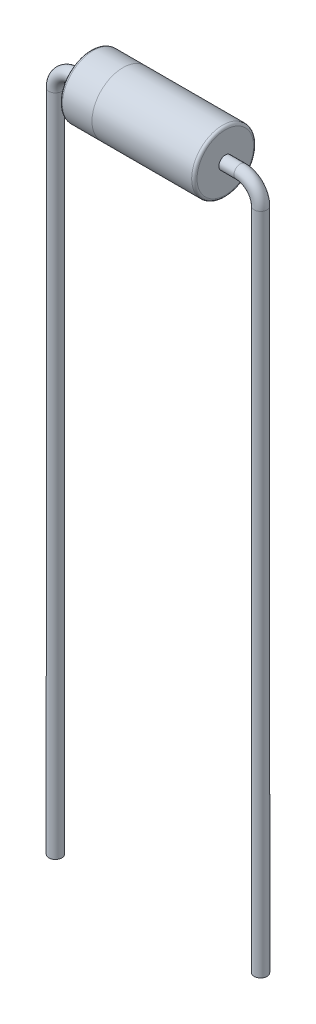
ISO-10303-21;
HEADER;
FILE_DESCRIPTION(('STEP AP214'),'2;1');
FILE_NAME('part.step','',(''),(''),'','','');
FILE_SCHEMA(('AUTOMOTIVE_DESIGN { 1 0 10303 214 1 1 1 1 }'));
ENDSEC;
DATA;
#1=APPLICATION_CONTEXT('core data for automotive mechanical design processes');
#2=APPLICATION_PROTOCOL_DEFINITION('international standard','automotive_design',2000,#1);
#3=PRODUCT_CONTEXT('',#1,'mechanical');
#4=PRODUCT('Part','Part','',(#3));
#5=PRODUCT_RELATED_PRODUCT_CATEGORY('part','',(#4));
#6=PRODUCT_DEFINITION_FORMATION('','',#4);
#7=PRODUCT_DEFINITION_CONTEXT('part definition',#1,'design');
#8=PRODUCT_DEFINITION('design','',#6,#7);
#9=PRODUCT_DEFINITION_SHAPE('','',#8);
#10=(LENGTH_UNIT() NAMED_UNIT(*) SI_UNIT(.MILLI.,.METRE.));
#11=(NAMED_UNIT(*) PLANE_ANGLE_UNIT() SI_UNIT($,.RADIAN.));
#12=(NAMED_UNIT(*) SI_UNIT($,.STERADIAN.) SOLID_ANGLE_UNIT());
#13=UNCERTAINTY_MEASURE_WITH_UNIT(LENGTH_MEASURE(1.E-05),#10,'distance_accuracy_value','');
#14=(GEOMETRIC_REPRESENTATION_CONTEXT(3) GLOBAL_UNCERTAINTY_ASSIGNED_CONTEXT((#13)) GLOBAL_UNIT_ASSIGNED_CONTEXT((#10,
#11,#12)) REPRESENTATION_CONTEXT('',''));
#15=CARTESIAN_POINT('',(0.,0.,0.));
#16=DIRECTION('',(0.,0.,1.));
#17=DIRECTION('',(1.,0.,0.));
#18=AXIS2_PLACEMENT_3D('',#15,#16,#17);
#19=CARTESIAN_POINT('',(-2.4,0.,0.));
#20=DIRECTION('',(-1.,0.,0.));
#21=DIRECTION('',(0.,0.,1.));
#22=AXIS2_PLACEMENT_3D('',#19,#20,#21);
#23=TOROIDAL_SURFACE('',#22,1.05,0.1);
#24=CARTESIAN_POINT('',(-2.5,0.,0.));
#25=DIRECTION('',(-1.,0.,0.));
#26=DIRECTION('',(0.,0.,1.));
#27=AXIS2_PLACEMENT_3D('',#24,#25,#26);
#28=CIRCLE('',#27,1.05);
#29=CARTESIAN_POINT('',(-2.5,0.,1.05));
#30=VERTEX_POINT('',#29);
#31=EDGE_CURVE('E11',#30,#30,#28,.T.);
#32=ORIENTED_EDGE('',*,*,#31,.F.);
#33=EDGE_LOOP('',(#32));
#34=FACE_BOUND('',#33,.T.);
#35=CARTESIAN_POINT('',(-2.4,0.,0.));
#36=DIRECTION('',(-1.,0.,0.));
#37=DIRECTION('',(0.,0.,1.));
#38=AXIS2_PLACEMENT_3D('',#35,#36,#37);
#39=CIRCLE('',#38,1.15);
#40=CARTESIAN_POINT('',(-2.4,0.,1.15));
#41=VERTEX_POINT('',#40);
#42=EDGE_CURVE('E55',#41,#41,#39,.T.);
#43=ORIENTED_EDGE('',*,*,#42,.T.);
#44=EDGE_LOOP('',(#43));
#45=FACE_BOUND('',#44,.T.);
#46=ADVANCED_FACE('F45',(#34,#45),#23,.T.);
#47=CARTESIAN_POINT('',(-2.5,1.05,0.));
#48=DIRECTION('',(1.,0.,0.));
#49=DIRECTION('',(0.,0.,-1.));
#50=AXIS2_PLACEMENT_3D('',#47,#48,#49);
#51=PLANE('',#50);
#52=ORIENTED_EDGE('',*,*,#31,.T.);
#53=EDGE_LOOP('',(#52));
#54=FACE_BOUND('',#53,.T.);
#55=ADVANCED_FACE('F69',(#54),#51,.F.);
#56=CARTESIAN_POINT('',(-1.3,1.15,0.));
#57=DIRECTION('',(-1.,0.,0.));
#58=DIRECTION('',(0.,0.,1.));
#59=AXIS2_PLACEMENT_3D('',#56,#57,#58);
#60=PLANE('',#59);
#61=CARTESIAN_POINT('',(-1.3,0.,0.));
#62=DIRECTION('',(-1.,0.,0.));
#63=DIRECTION('',(0.,0.,1.));
#64=AXIS2_PLACEMENT_3D('',#61,#62,#63);
#65=CIRCLE('',#64,1.15);
#66=CARTESIAN_POINT('',(-1.3,0.,1.15));
#67=VERTEX_POINT('',#66);
#68=EDGE_CURVE('E51',#67,#67,#65,.T.);
#69=ORIENTED_EDGE('',*,*,#68,.F.);
#70=EDGE_LOOP('',(#69));
#71=FACE_BOUND('',#70,.T.);
#72=ADVANCED_FACE('F65',(#71),#60,.F.);
#73=CARTESIAN_POINT('',(-2.5,0.,0.));
#74=DIRECTION('',(-1.,0.,0.));
#75=DIRECTION('',(0.,0.,1.));
#76=AXIS2_PLACEMENT_3D('',#73,#74,#75);
#77=CYLINDRICAL_SURFACE('',#76,1.15);
#78=ORIENTED_EDGE('',*,*,#42,.F.);
#79=EDGE_LOOP('',(#78));
#80=FACE_BOUND('',#79,.T.);
#81=ORIENTED_EDGE('',*,*,#68,.T.);
#82=EDGE_LOOP('',(#81));
#83=FACE_BOUND('',#82,.T.);
#84=ADVANCED_FACE('F63',(#80,#83),#77,.T.);
#85=CLOSED_SHELL('',(#46,#55,#72,#84));
#86=MANIFOLD_SOLID_BREP('B2',#85);
#87=CARTESIAN_POINT('',(-1.3,1.15,0.));
#88=DIRECTION('',(1.,0.,0.));
#89=DIRECTION('',(0.,0.,-1.));
#90=AXIS2_PLACEMENT_3D('',#87,#88,#89);
#91=PLANE('',#90);
#92=CARTESIAN_POINT('',(-1.3,0.,0.));
#93=DIRECTION('',(-1.,0.,0.));
#94=DIRECTION('',(0.,0.,1.));
#95=AXIS2_PLACEMENT_3D('',#92,#93,#94);
#96=CIRCLE('',#95,1.15);
#97=CARTESIAN_POINT('',(-1.3,0.,1.15));
#98=VERTEX_POINT('',#97);
#99=EDGE_CURVE('E44',#98,#98,#96,.T.);
#100=ORIENTED_EDGE('',*,*,#99,.T.);
#101=EDGE_LOOP('',(#100));
#102=FACE_BOUND('',#101,.T.);
#103=ADVANCED_FACE('F109',(#102),#91,.F.);
#104=CARTESIAN_POINT('',(-1.3,0.,0.));
#105=DIRECTION('',(-1.,0.,0.));
#106=DIRECTION('',(0.,0.,1.));
#107=AXIS2_PLACEMENT_3D('',#104,#105,#106);
#108=CYLINDRICAL_SURFACE('',#107,1.15);
#109=ORIENTED_EDGE('',*,*,#99,.F.);
#110=EDGE_LOOP('',(#109));
#111=FACE_BOUND('',#110,.T.);
#112=CARTESIAN_POINT('',(2.4,0.,0.));
#113=DIRECTION('',(-1.,0.,0.));
#114=DIRECTION('',(0.,0.,1.));
#115=AXIS2_PLACEMENT_3D('',#112,#113,#114);
#116=CIRCLE('',#115,1.15);
#117=CARTESIAN_POINT('',(2.4,0.,1.15));
#118=VERTEX_POINT('',#117);
#119=EDGE_CURVE('E115',#118,#118,#116,.T.);
#120=ORIENTED_EDGE('',*,*,#119,.T.);
#121=EDGE_LOOP('',(#120));
#122=FACE_BOUND('',#121,.T.);
#123=ADVANCED_FACE('F134',(#111,#122),#108,.T.);
#124=CARTESIAN_POINT('',(2.4,0.,0.));
#125=DIRECTION('',(-1.,0.,0.));
#126=DIRECTION('',(0.,0.,1.));
#127=AXIS2_PLACEMENT_3D('',#124,#125,#126);
#128=TOROIDAL_SURFACE('',#127,1.05,0.0999999999999999);
#129=ORIENTED_EDGE('',*,*,#119,.F.);
#130=EDGE_LOOP('',(#129));
#131=FACE_BOUND('',#130,.T.);
#132=CARTESIAN_POINT('',(2.5,0.,0.));
#133=DIRECTION('',(-1.,0.,0.));
#134=DIRECTION('',(0.,0.,1.));
#135=AXIS2_PLACEMENT_3D('',#132,#133,#134);
#136=CIRCLE('',#135,1.05);
#137=CARTESIAN_POINT('',(2.5,0.,1.05));
#138=VERTEX_POINT('',#137);
#139=EDGE_CURVE('E119',#138,#138,#136,.T.);
#140=ORIENTED_EDGE('',*,*,#139,.T.);
#141=EDGE_LOOP('',(#140));
#142=FACE_BOUND('',#141,.T.);
#143=ADVANCED_FACE('F126',(#131,#142),#128,.T.);
#144=CARTESIAN_POINT('',(2.5,1.05,0.));
#145=DIRECTION('',(-1.,0.,0.));
#146=DIRECTION('',(0.,0.,1.));
#147=AXIS2_PLACEMENT_3D('',#144,#145,#146);
#148=PLANE('',#147);
#149=ORIENTED_EDGE('',*,*,#139,.F.);
#150=EDGE_LOOP('',(#149));
#151=FACE_BOUND('',#150,.T.);
#152=ADVANCED_FACE('F128',(#151),#148,.F.);
#153=CLOSED_SHELL('',(#103,#123,#143,#152));
#154=MANIFOLD_SOLID_BREP('B6',#153);
#155=CARTESIAN_POINT('',(3.81000000000001,-25.4,0.));
#156=DIRECTION('',(0.,1.,0.));
#157=DIRECTION('',(-1.,0.,0.));
#158=AXIS2_PLACEMENT_3D('',#155,#156,#157);
#159=PLANE('',#158);
#160=CARTESIAN_POINT('',(3.81000000000001,-25.4,0.));
#161=DIRECTION('',(0.,1.,0.));
#162=DIRECTION('',(-1.,0.,0.));
#163=AXIS2_PLACEMENT_3D('',#160,#161,#162);
#164=CIRCLE('',#163,0.24);
#165=CARTESIAN_POINT('',(3.57000000000001,-25.4,0.));
#166=VERTEX_POINT('',#165);
#167=EDGE_CURVE('E187',#166,#166,#164,.T.);
#168=ORIENTED_EDGE('',*,*,#167,.F.);
#169=EDGE_LOOP('',(#168));
#170=FACE_BOUND('',#169,.T.);
#171=ADVANCED_FACE('F165',(#170),#159,.F.);
#172=CARTESIAN_POINT('',(-3.81,-25.4,0.));
#173=DIRECTION('',(0.,-1.,0.));
#174=DIRECTION('',(1.,0.,0.));
#175=AXIS2_PLACEMENT_3D('',#172,#173,#174);
#176=PLANE('',#175);
#177=CARTESIAN_POINT('',(-3.81,-25.4,0.));
#178=DIRECTION('',(0.,-1.,0.));
#179=DIRECTION('',(1.,0.,0.));
#180=AXIS2_PLACEMENT_3D('',#177,#178,#179);
#181=CIRCLE('',#180,0.24);
#182=CARTESIAN_POINT('',(-3.57,-25.4,0.));
#183=VERTEX_POINT('',#182);
#184=EDGE_CURVE('E108',#183,#183,#181,.T.);
#185=ORIENTED_EDGE('',*,*,#184,.T.);
#186=EDGE_LOOP('',(#185));
#187=FACE_BOUND('',#186,.T.);
#188=ADVANCED_FACE('F194',(#187),#176,.T.);
#189=CARTESIAN_POINT('',(3.81000000000001,-25.4,0.));
#190=DIRECTION('',(0.,1.,0.));
#191=DIRECTION('',(-1.,0.,0.));
#192=AXIS2_PLACEMENT_3D('',#189,#190,#191);
#193=CYLINDRICAL_SURFACE('',#192,0.24);
#194=CARTESIAN_POINT('',(3.81,-0.749999999999997,0.));
#195=DIRECTION('',(0.,1.,0.));
#196=DIRECTION('',(-1.,0.,0.));
#197=AXIS2_PLACEMENT_3D('',#194,#195,#196);
#198=CIRCLE('',#197,0.24);
#199=CARTESIAN_POINT('',(4.05,-0.749999999999996,0.));
#200=VERTEX_POINT('',#199);
#201=EDGE_CURVE('E184',#200,#200,#198,.T.);
#202=ORIENTED_EDGE('',*,*,#201,.F.);
#203=EDGE_LOOP('',(#202));
#204=FACE_BOUND('',#203,.T.);
#205=ORIENTED_EDGE('',*,*,#167,.T.);
#206=EDGE_LOOP('',(#205));
#207=FACE_BOUND('',#206,.T.);
#208=ADVANCED_FACE('F191',(#204,#207),#193,.T.);
#209=CARTESIAN_POINT('',(3.06,-0.75,0.));
#210=DIRECTION('',(0.,0.,1.));
#211=DIRECTION('',(1.,0.,0.));
#212=AXIS2_PLACEMENT_3D('',#209,#210,#211);
#213=TOROIDAL_SURFACE('',#212,0.75,0.24);
#214=CARTESIAN_POINT('',(3.06,0.,0.));
#215=DIRECTION('',(-1.,0.,0.));
#216=DIRECTION('',(0.,-1.,0.));
#217=AXIS2_PLACEMENT_3D('',#214,#215,#216);
#218=CIRCLE('',#217,0.24);
#219=CARTESIAN_POINT('',(3.06,0.24,0.));
#220=VERTEX_POINT('',#219);
#221=EDGE_CURVE('E179',#220,#220,#218,.T.);
#222=CARTESIAN_POINT('',(3.06,-0.75,0.));
#223=DIRECTION('',(0.,0.,1.));
#224=DIRECTION('',(1.,0.,0.));
#225=AXIS2_PLACEMENT_3D('',#222,#223,#224);
#226=CIRCLE('',#225,0.99);
#227=EDGE_CURVE('',#200,#220,#226,.T.);
#228=ORIENTED_EDGE('',*,*,#201,.T.);
#229=ORIENTED_EDGE('',*,*,#221,.F.);
#230=ORIENTED_EDGE('',*,*,#227,.T.);
#231=ORIENTED_EDGE('',*,*,#227,.F.);
#232=EDGE_LOOP('',(#228,#230,#229,#231));
#233=FACE_BOUND('',#232,.T.);
#234=ADVANCED_FACE('F212',(#233),#213,.T.);
#235=CARTESIAN_POINT('',(3.06,0.,0.));
#236=DIRECTION('',(-1.,0.,0.));
#237=DIRECTION('',(0.,0.,1.));
#238=AXIS2_PLACEMENT_3D('',#235,#236,#237);
#239=CYLINDRICAL_SURFACE('',#238,0.24);
#240=CARTESIAN_POINT('',(-3.06,0.,0.));
#241=DIRECTION('',(-1.,0.,0.));
#242=DIRECTION('',(0.,-1.,0.));
#243=AXIS2_PLACEMENT_3D('',#240,#241,#242);
#244=CIRCLE('',#243,0.24);
#245=CARTESIAN_POINT('',(-3.06,0.239999999999999,0.));
#246=VERTEX_POINT('',#245);
#247=EDGE_CURVE('E175',#246,#246,#244,.T.);
#248=ORIENTED_EDGE('',*,*,#247,.F.);
#249=EDGE_LOOP('',(#248));
#250=FACE_BOUND('',#249,.T.);
#251=ORIENTED_EDGE('',*,*,#221,.T.);
#252=EDGE_LOOP('',(#251));
#253=FACE_BOUND('',#252,.T.);
#254=ADVANCED_FACE('F206',(#250,#253),#239,.T.);
#255=CARTESIAN_POINT('',(-3.06,-0.75,0.));
#256=DIRECTION('',(0.,0.,1.));
#257=DIRECTION('',(1.,0.,0.));
#258=AXIS2_PLACEMENT_3D('',#255,#256,#257);
#259=TOROIDAL_SURFACE('',#258,0.75,0.24);
#260=CARTESIAN_POINT('',(-3.81,-0.750000000000001,0.));
#261=DIRECTION('',(0.,-1.,0.));
#262=DIRECTION('',(1.,0.,0.));
#263=AXIS2_PLACEMENT_3D('',#260,#261,#262);
#264=CIRCLE('',#263,0.24);
#265=CARTESIAN_POINT('',(-4.05,-0.750000000000001,0.));
#266=VERTEX_POINT('',#265);
#267=EDGE_CURVE('E171',#266,#266,#264,.T.);
#268=CARTESIAN_POINT('',(-3.06,-0.75,0.));
#269=DIRECTION('',(0.,0.,1.));
#270=DIRECTION('',(1.,0.,0.));
#271=AXIS2_PLACEMENT_3D('',#268,#269,#270);
#272=CIRCLE('',#271,0.989999999999999);
#273=EDGE_CURVE('',#246,#266,#272,.T.);
#274=ORIENTED_EDGE('',*,*,#247,.T.);
#275=ORIENTED_EDGE('',*,*,#267,.F.);
#276=ORIENTED_EDGE('',*,*,#273,.T.);
#277=ORIENTED_EDGE('',*,*,#273,.F.);
#278=EDGE_LOOP('',(#274,#276,#275,#277));
#279=FACE_BOUND('',#278,.T.);
#280=ADVANCED_FACE('F200',(#279),#259,.T.);
#281=CARTESIAN_POINT('',(-3.81,-0.750000000000001,0.));
#282=DIRECTION('',(0.,-1.,0.));
#283=DIRECTION('',(1.,0.,0.));
#284=AXIS2_PLACEMENT_3D('',#281,#282,#283);
#285=CYLINDRICAL_SURFACE('',#284,0.24);
#286=ORIENTED_EDGE('',*,*,#184,.F.);
#287=EDGE_LOOP('',(#286));
#288=FACE_BOUND('',#287,.T.);
#289=ORIENTED_EDGE('',*,*,#267,.T.);
#290=EDGE_LOOP('',(#289));
#291=FACE_BOUND('',#290,.T.);
#292=ADVANCED_FACE('F198',(#288,#291),#285,.T.);
#293=CLOSED_SHELL('',(#171,#188,#208,#234,#254,#280,#292));
#294=MANIFOLD_SOLID_BREP('B39',#293);
#295=ADVANCED_BREP_SHAPE_REPRESENTATION('',(#18,#86,#154,#294),#14);
#296=SHAPE_DEFINITION_REPRESENTATION(#9,#295);
ENDSEC;
END-ISO-10303-21;
